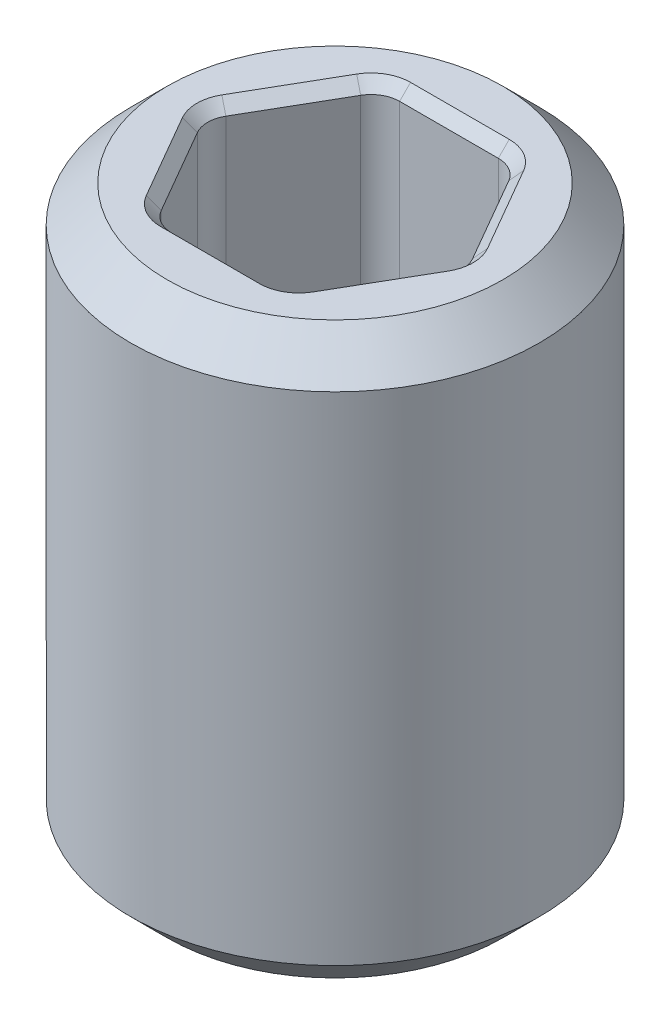
ISO-10303-21;
HEADER;
FILE_DESCRIPTION(('STEP AP214'),'2;1');
FILE_NAME('part.step','',(''),(''),'','','');
FILE_SCHEMA(('AUTOMOTIVE_DESIGN { 1 0 10303 214 1 1 1 1 }'));
ENDSEC;
DATA;
#1=APPLICATION_CONTEXT('core data for automotive mechanical design processes');
#2=APPLICATION_PROTOCOL_DEFINITION('international standard','automotive_design',2000,#1);
#3=PRODUCT_CONTEXT('',#1,'mechanical');
#4=PRODUCT('Part','Part','',(#3));
#5=PRODUCT_RELATED_PRODUCT_CATEGORY('part','',(#4));
#6=PRODUCT_DEFINITION_FORMATION('','',#4);
#7=PRODUCT_DEFINITION_CONTEXT('part definition',#1,'design');
#8=PRODUCT_DEFINITION('design','',#6,#7);
#9=PRODUCT_DEFINITION_SHAPE('','',#8);
#10=(LENGTH_UNIT() NAMED_UNIT(*) SI_UNIT(.MILLI.,.METRE.));
#11=(NAMED_UNIT(*) PLANE_ANGLE_UNIT() SI_UNIT($,.RADIAN.));
#12=(NAMED_UNIT(*) SI_UNIT($,.STERADIAN.) SOLID_ANGLE_UNIT());
#13=UNCERTAINTY_MEASURE_WITH_UNIT(LENGTH_MEASURE(1.E-05),#10,'distance_accuracy_value','');
#14=(GEOMETRIC_REPRESENTATION_CONTEXT(3) GLOBAL_UNCERTAINTY_ASSIGNED_CONTEXT((#13)) GLOBAL_UNIT_ASSIGNED_CONTEXT((#10,
#11,#12)) REPRESENTATION_CONTEXT('',''));
#15=CARTESIAN_POINT('',(0.,0.,0.));
#16=DIRECTION('',(0.,0.,1.));
#17=DIRECTION('',(1.,0.,0.));
#18=AXIS2_PLACEMENT_3D('',#15,#16,#17);
#19=CARTESIAN_POINT('',(0.,-1.984375,0.));
#20=DIRECTION('',(0.,-1.,0.));
#21=DIRECTION('',(0.,0.,-1.));
#22=AXIS2_PLACEMENT_3D('',#19,#20,#21);
#23=PLANE('',#22);
#24=CARTESIAN_POINT('',(0.343703832126949,-1.984375,0.5953125));
#25=DIRECTION('',(0.,-1.,0.));
#26=DIRECTION('',(0.,0.,-1.));
#27=AXIS2_PLACEMENT_3D('',#24,#25,#26);
#28=CIRCLE('',#27,0.2746375);
#29=CARTESIAN_POINT('',(0.343703832126949,-1.984375,0.86995));
#30=VERTEX_POINT('',#29);
#31=CARTESIAN_POINT('',(0.581546883958798,-1.984375,0.73263125));
#32=VERTEX_POINT('',#31);
#33=EDGE_CURVE('E428',#30,#32,#28,.F.);
#34=ORIENTED_EDGE('',*,*,#33,.T.);
#35=DIRECTION('',(0.499999999999999,0.,-0.866025403784439));
#36=VECTOR('',#35,1.);
#37=CARTESIAN_POINT('',(0.925250716085747,-1.984375,0.137318749999999));
#38=LINE('',#37,#36);
#39=CARTESIAN_POINT('',(0.925250716085747,-1.984375,0.137318749999999));
#40=VERTEX_POINT('',#39);
#41=EDGE_CURVE('E432',#32,#40,#38,.T.);
#42=ORIENTED_EDGE('',*,*,#41,.T.);
#43=CARTESIAN_POINT('',(0.687407664253898,-1.984375,0.));
#44=DIRECTION('',(0.,-1.,0.));
#45=DIRECTION('',(0.,0.,-1.));
#46=AXIS2_PLACEMENT_3D('',#43,#44,#45);
#47=CIRCLE('',#46,0.2746375);
#48=CARTESIAN_POINT('',(0.925250716085747,-1.984375,-0.137318750000001));
#49=VERTEX_POINT('',#48);
#50=EDGE_CURVE('E430',#40,#49,#47,.F.);
#51=ORIENTED_EDGE('',*,*,#50,.T.);
#52=DIRECTION('',(-0.5,0.,-0.866025403784439));
#53=VECTOR('',#52,1.);
#54=CARTESIAN_POINT('',(0.581546883958798,-1.984375,-0.73263125));
#55=LINE('',#54,#53);
#56=CARTESIAN_POINT('',(0.581546883958798,-1.984375,-0.73263125));
#57=VERTEX_POINT('',#56);
#58=EDGE_CURVE('E426',#49,#57,#55,.T.);
#59=ORIENTED_EDGE('',*,*,#58,.T.);
#60=CARTESIAN_POINT('',(0.343703832126949,-1.984375,-0.5953125));
#61=DIRECTION('',(0.,-1.,0.));
#62=DIRECTION('',(0.,0.,-1.));
#63=AXIS2_PLACEMENT_3D('',#60,#61,#62);
#64=CIRCLE('',#63,0.2746375);
#65=CARTESIAN_POINT('',(0.343703832126949,-1.984375,-0.86995));
#66=VERTEX_POINT('',#65);
#67=EDGE_CURVE('E418',#57,#66,#64,.F.);
#68=ORIENTED_EDGE('',*,*,#67,.T.);
#69=DIRECTION('',(-1.,0.,0.));
#70=VECTOR('',#69,1.);
#71=CARTESIAN_POINT('',(-0.343703832126949,-1.984375,-0.86995));
#72=LINE('',#71,#70);
#73=CARTESIAN_POINT('',(-0.343703832126949,-1.984375,-0.86995));
#74=VERTEX_POINT('',#73);
#75=EDGE_CURVE('E200',#66,#74,#72,.T.);
#76=ORIENTED_EDGE('',*,*,#75,.T.);
#77=CARTESIAN_POINT('',(-0.343703832126949,-1.984375,-0.5953125));
#78=DIRECTION('',(0.,-1.,0.));
#79=DIRECTION('',(0.,0.,-1.));
#80=AXIS2_PLACEMENT_3D('',#77,#78,#79);
#81=CIRCLE('',#80,0.2746375);
#82=CARTESIAN_POINT('',(-0.581546883958798,-1.984375,-0.73263125));
#83=VERTEX_POINT('',#82);
#84=EDGE_CURVE('E194',#74,#83,#81,.F.);
#85=ORIENTED_EDGE('',*,*,#84,.T.);
#86=DIRECTION('',(-0.499999999999999,0.,0.866025403784439));
#87=VECTOR('',#86,1.);
#88=CARTESIAN_POINT('',(-0.925250716085747,-1.984375,-0.137318749999999));
#89=LINE('',#88,#87);
#90=CARTESIAN_POINT('',(-0.925250716085747,-1.984375,-0.13731875));
#91=VERTEX_POINT('',#90);
#92=EDGE_CURVE('E197',#83,#91,#89,.T.);
#93=ORIENTED_EDGE('',*,*,#92,.T.);
#94=CARTESIAN_POINT('',(-0.687407664253898,-1.984375,0.));
#95=DIRECTION('',(0.,-1.,0.));
#96=DIRECTION('',(0.,0.,-1.));
#97=AXIS2_PLACEMENT_3D('',#94,#95,#96);
#98=CIRCLE('',#97,0.2746375);
#99=CARTESIAN_POINT('',(-0.925250716085747,-1.984375,0.137318750000001));
#100=VERTEX_POINT('',#99);
#101=EDGE_CURVE('E206',#91,#100,#98,.F.);
#102=ORIENTED_EDGE('',*,*,#101,.T.);
#103=DIRECTION('',(0.500000000000001,0.,0.866025403784438));
#104=VECTOR('',#103,1.);
#105=CARTESIAN_POINT('',(-0.581546883958797,-1.984375,0.732631250000001));
#106=LINE('',#105,#104);
#107=CARTESIAN_POINT('',(-0.581546883958797,-1.984375,0.73263125));
#108=VERTEX_POINT('',#107);
#109=EDGE_CURVE('E205',#100,#108,#106,.T.);
#110=ORIENTED_EDGE('',*,*,#109,.T.);
#111=CARTESIAN_POINT('',(-0.343703832126948,-1.984375,0.5953125));
#112=DIRECTION('',(0.,-1.,0.));
#113=DIRECTION('',(0.,0.,-1.));
#114=AXIS2_PLACEMENT_3D('',#111,#112,#113);
#115=CIRCLE('',#114,0.2746375);
#116=CARTESIAN_POINT('',(-0.343703832126948,-1.984375,0.86995));
#117=VERTEX_POINT('',#116);
#118=EDGE_CURVE('E416',#108,#117,#115,.F.);
#119=ORIENTED_EDGE('',*,*,#118,.T.);
#120=DIRECTION('',(1.,0.,0.));
#121=VECTOR('',#120,1.);
#122=CARTESIAN_POINT('',(0.343703832126949,-1.984375,0.86995));
#123=LINE('',#122,#121);
#124=EDGE_CURVE('E420',#117,#30,#123,.T.);
#125=ORIENTED_EDGE('',*,*,#124,.T.);
#126=EDGE_LOOP('',(#34,#42,#51,#59,#68,#76,#85,#93,#102,#110,#119,#125));
#127=FACE_BOUND('',#126,.T.);
#128=CARTESIAN_POINT('',(0.,-1.984375,0.));
#129=DIRECTION('',(0.,-1.,0.));
#130=DIRECTION('',(0.,0.,-1.));
#131=AXIS2_PLACEMENT_3D('',#128,#129,#130);
#132=CIRCLE('',#131,1.1684);
#133=CARTESIAN_POINT('',(0.,-1.984375,-1.1684));
#134=VERTEX_POINT('',#133);
#135=EDGE_CURVE('E462',#134,#134,#132,.T.);
#136=ORIENTED_EDGE('',*,*,#135,.T.);
#137=EDGE_LOOP('',(#136));
#138=FACE_BOUND('',#137,.T.);
#139=ADVANCED_FACE('F32',(#127,#138),#23,.T.);
#140=CARTESIAN_POINT('',(0.,-1.70416602917091,0.));
#141=DIRECTION('',(0.,-1.,0.));
#142=DIRECTION('',(0.,0.,-1.));
#143=AXIS2_PLACEMENT_3D('',#140,#141,#142);
#144=CYLINDRICAL_SURFACE('',#143,1.4224);
#145=CARTESIAN_POINT('',(0.,-1.730375,0.));
#146=DIRECTION('',(0.,-1.,0.));
#147=DIRECTION('',(0.,0.,-1.));
#148=AXIS2_PLACEMENT_3D('',#145,#146,#147);
#149=CIRCLE('',#148,1.4224);
#150=CARTESIAN_POINT('',(0.,-1.730375,-1.4224));
#151=VERTEX_POINT('',#150);
#152=EDGE_CURVE('E468',#151,#151,#149,.F.);
#153=ORIENTED_EDGE('',*,*,#152,.T.);
#154=EDGE_LOOP('',(#153));
#155=FACE_BOUND('',#154,.T.);
#156=CARTESIAN_POINT('',(0.,1.730375,0.));
#157=DIRECTION('',(0.,1.,0.));
#158=DIRECTION('',(0.,0.,1.));
#159=AXIS2_PLACEMENT_3D('',#156,#157,#158);
#160=CIRCLE('',#159,1.4224);
#161=CARTESIAN_POINT('',(0.,1.730375,1.4224));
#162=VERTEX_POINT('',#161);
#163=EDGE_CURVE('E465',#162,#162,#160,.F.);
#164=ORIENTED_EDGE('',*,*,#163,.T.);
#165=EDGE_LOOP('',(#164));
#166=FACE_BOUND('',#165,.T.);
#167=ADVANCED_FACE('F551',(#155,#166),#144,.T.);
#168=CARTESIAN_POINT('',(1.4224,1.984375,0.));
#169=DIRECTION('',(0.,1.,0.));
#170=DIRECTION('',(0.,0.,1.));
#171=AXIS2_PLACEMENT_3D('',#168,#169,#170);
#172=PLANE('',#171);
#173=CARTESIAN_POINT('',(0.343703832126949,1.984375,-0.5953125));
#174=DIRECTION('',(0.,1.,0.));
#175=DIRECTION('',(0.,0.,1.));
#176=AXIS2_PLACEMENT_3D('',#173,#174,#175);
#177=CIRCLE('',#176,0.274637500000002);
#178=CARTESIAN_POINT('',(0.343703832126949,1.984375,-0.869950000000002));
#179=VERTEX_POINT('',#178);
#180=CARTESIAN_POINT('',(0.581546883958799,1.984375,-0.732631250000001));
#181=VERTEX_POINT('',#180);
#182=EDGE_CURVE('E41',#179,#181,#177,.F.);
#183=ORIENTED_EDGE('',*,*,#182,.T.);
#184=DIRECTION('',(0.5,0.,0.866025403784439));
#185=VECTOR('',#184,1.);
#186=CARTESIAN_POINT('',(0.925250716085748,1.984375,-0.137318750000001));
#187=LINE('',#186,#185);
#188=CARTESIAN_POINT('',(0.925250716085748,1.984375,-0.137318750000002));
#189=VERTEX_POINT('',#188);
#190=EDGE_CURVE('E11',#181,#189,#187,.T.);
#191=ORIENTED_EDGE('',*,*,#190,.T.);
#192=CARTESIAN_POINT('',(0.687407664253898,1.984375,0.));
#193=DIRECTION('',(0.,1.,0.));
#194=DIRECTION('',(0.,0.,1.));
#195=AXIS2_PLACEMENT_3D('',#192,#193,#194);
#196=CIRCLE('',#195,0.274637500000002);
#197=CARTESIAN_POINT('',(0.925250716085748,1.984375,0.13731875));
#198=VERTEX_POINT('',#197);
#199=EDGE_CURVE('E344',#189,#198,#196,.F.);
#200=ORIENTED_EDGE('',*,*,#199,.T.);
#201=DIRECTION('',(-0.499999999999999,0.,0.866025403784439));
#202=VECTOR('',#201,1.);
#203=CARTESIAN_POINT('',(0.5815468839588,1.984375,0.732631250000001));
#204=LINE('',#203,#202);
#205=CARTESIAN_POINT('',(0.5815468839588,1.984375,0.732631250000001));
#206=VERTEX_POINT('',#205);
#207=EDGE_CURVE('E340',#198,#206,#204,.T.);
#208=ORIENTED_EDGE('',*,*,#207,.T.);
#209=CARTESIAN_POINT('',(0.343703832126949,1.984375,0.5953125));
#210=DIRECTION('',(0.,1.,0.));
#211=DIRECTION('',(0.,0.,1.));
#212=AXIS2_PLACEMENT_3D('',#209,#210,#211);
#213=CIRCLE('',#212,0.274637500000002);
#214=CARTESIAN_POINT('',(0.343703832126949,1.984375,0.869950000000002));
#215=VERTEX_POINT('',#214);
#216=EDGE_CURVE('E336',#206,#215,#213,.F.);
#217=ORIENTED_EDGE('',*,*,#216,.T.);
#218=DIRECTION('',(-1.,0.,0.));
#219=VECTOR('',#218,1.);
#220=CARTESIAN_POINT('',(-0.343703832126948,1.984375,0.869950000000002));
#221=LINE('',#220,#219);
#222=CARTESIAN_POINT('',(-0.343703832126948,1.984375,0.869950000000002));
#223=VERTEX_POINT('',#222);
#224=EDGE_CURVE('E332',#215,#223,#221,.T.);
#225=ORIENTED_EDGE('',*,*,#224,.T.);
#226=CARTESIAN_POINT('',(-0.343703832126948,1.984375,0.5953125));
#227=DIRECTION('',(0.,1.,0.));
#228=DIRECTION('',(0.,0.,1.));
#229=AXIS2_PLACEMENT_3D('',#226,#227,#228);
#230=CIRCLE('',#229,0.274637500000002);
#231=CARTESIAN_POINT('',(-0.581546883958799,1.984375,0.732631250000001));
#232=VERTEX_POINT('',#231);
#233=EDGE_CURVE('E328',#223,#232,#230,.F.);
#234=ORIENTED_EDGE('',*,*,#233,.T.);
#235=DIRECTION('',(-0.500000000000001,0.,-0.866025403784438));
#236=VECTOR('',#235,1.);
#237=CARTESIAN_POINT('',(-0.925250716085748,1.984375,0.137318750000002));
#238=LINE('',#237,#236);
#239=CARTESIAN_POINT('',(-0.925250716085748,1.984375,0.137318750000002));
#240=VERTEX_POINT('',#239);
#241=EDGE_CURVE('E326',#232,#240,#238,.T.);
#242=ORIENTED_EDGE('',*,*,#241,.T.);
#243=CARTESIAN_POINT('',(-0.687407664253898,1.984375,0.));
#244=DIRECTION('',(0.,1.,0.));
#245=DIRECTION('',(0.,0.,1.));
#246=AXIS2_PLACEMENT_3D('',#243,#244,#245);
#247=CIRCLE('',#246,0.274637500000002);
#248=CARTESIAN_POINT('',(-0.925250716085748,1.984375,-0.13731875));
#249=VERTEX_POINT('',#248);
#250=EDGE_CURVE('E330',#240,#249,#247,.F.);
#251=ORIENTED_EDGE('',*,*,#250,.T.);
#252=DIRECTION('',(0.499999999999999,0.,-0.866025403784439));
#253=VECTOR('',#252,1.);
#254=CARTESIAN_POINT('',(-0.5815468839588,1.984375,-0.732631250000001));
#255=LINE('',#254,#253);
#256=CARTESIAN_POINT('',(-0.5815468839588,1.984375,-0.732631250000001));
#257=VERTEX_POINT('',#256);
#258=EDGE_CURVE('E334',#249,#257,#255,.T.);
#259=ORIENTED_EDGE('',*,*,#258,.T.);
#260=CARTESIAN_POINT('',(-0.343703832126949,1.984375,-0.5953125));
#261=DIRECTION('',(0.,1.,0.));
#262=DIRECTION('',(0.,0.,1.));
#263=AXIS2_PLACEMENT_3D('',#260,#261,#262);
#264=CIRCLE('',#263,0.274637500000002);
#265=CARTESIAN_POINT('',(-0.343703832126949,1.984375,-0.869950000000002));
#266=VERTEX_POINT('',#265);
#267=EDGE_CURVE('E338',#257,#266,#264,.F.);
#268=ORIENTED_EDGE('',*,*,#267,.T.);
#269=DIRECTION('',(1.,0.,0.));
#270=VECTOR('',#269,1.);
#271=CARTESIAN_POINT('',(0.343703832126949,1.984375,-0.869950000000002));
#272=LINE('',#271,#270);
#273=EDGE_CURVE('E342',#266,#179,#272,.T.);
#274=ORIENTED_EDGE('',*,*,#273,.T.);
#275=EDGE_LOOP('',(#183,#191,#200,#208,#217,#225,#234,#242,#251,#259,#268,#274));
#276=FACE_BOUND('',#275,.T.);
#277=CARTESIAN_POINT('',(0.,1.984375,0.));
#278=DIRECTION('',(0.,1.,0.));
#279=DIRECTION('',(0.,0.,1.));
#280=AXIS2_PLACEMENT_3D('',#277,#278,#279);
#281=CIRCLE('',#280,1.1684);
#282=CARTESIAN_POINT('',(0.,1.984375,1.1684));
#283=VERTEX_POINT('',#282);
#284=EDGE_CURVE('E217',#283,#283,#281,.T.);
#285=ORIENTED_EDGE('',*,*,#284,.T.);
#286=EDGE_LOOP('',(#285));
#287=FACE_BOUND('',#286,.T.);
#288=ADVANCED_FACE('F346',(#276,#287),#172,.T.);
#289=CARTESIAN_POINT('',(0.91654355233853,-1.984375,0.));
#290=DIRECTION('',(0.866025403784439,0.,-0.5));
#291=DIRECTION('',(-0.5,0.,-0.866025403784439));
#292=AXIS2_PLACEMENT_3D('',#289,#290,#291);
#293=PLANE('',#292);
#294=DIRECTION('',(0.,1.,0.));
#295=VECTOR('',#294,1.);
#296=CARTESIAN_POINT('',(0.515555748190423,-1.984375,-0.69453125));
#297=LINE('',#296,#295);
#298=CARTESIAN_POINT('',(0.515555748190423,1.908175,-0.69453125));
#299=VERTEX_POINT('',#298);
#300=CARTESIAN_POINT('',(0.515555748190423,-1.908175,-0.69453125));
#301=VERTEX_POINT('',#300);
#302=EDGE_CURVE('E223',#299,#301,#297,.F.);
#303=ORIENTED_EDGE('',*,*,#302,.T.);
#304=DIRECTION('',(0.5,0.,0.866025403784439));
#305=VECTOR('',#304,1.);
#306=CARTESIAN_POINT('',(0.859259580317372,-1.908175,-0.0992187500000006));
#307=LINE('',#306,#305);
#308=CARTESIAN_POINT('',(0.859259580317372,-1.908175,-0.0992187500000006));
#309=VERTEX_POINT('',#308);
#310=EDGE_CURVE('E378',#301,#309,#307,.T.);
#311=ORIENTED_EDGE('',*,*,#310,.T.);
#312=DIRECTION('',(0.,1.,0.));
#313=VECTOR('',#312,1.);
#314=CARTESIAN_POINT('',(0.859259580317372,1.984375,-0.0992187500000006));
#315=LINE('',#314,#313);
#316=CARTESIAN_POINT('',(0.859259580317372,1.908175,-0.0992187500000006));
#317=VERTEX_POINT('',#316);
#318=EDGE_CURVE('E446',#309,#317,#315,.T.);
#319=ORIENTED_EDGE('',*,*,#318,.T.);
#320=DIRECTION('',(-0.5,0.,-0.866025403784439));
#321=VECTOR('',#320,1.);
#322=CARTESIAN_POINT('',(0.515555748190423,1.908175,-0.69453125));
#323=LINE('',#322,#321);
#324=EDGE_CURVE('E375',#317,#299,#323,.T.);
#325=ORIENTED_EDGE('',*,*,#324,.T.);
#326=EDGE_LOOP('',(#303,#311,#319,#325));
#327=FACE_BOUND('',#326,.T.);
#328=ADVANCED_FACE('F530',(#327),#293,.F.);
#329=CARTESIAN_POINT('',(0.458271776169266,-1.984375,0.79375));
#330=DIRECTION('',(0.866025403784439,0.,0.499999999999999));
#331=DIRECTION('',(0.499999999999999,0.,-0.866025403784439));
#332=AXIS2_PLACEMENT_3D('',#329,#330,#331);
#333=PLANE('',#332);
#334=DIRECTION('',(0.,1.,0.));
#335=VECTOR('',#334,1.);
#336=CARTESIAN_POINT('',(0.859259580317372,-1.984375,0.0992187499999992));
#337=LINE('',#336,#335);
#338=CARTESIAN_POINT('',(0.859259580317372,1.908175,0.0992187499999992));
#339=VERTEX_POINT('',#338);
#340=CARTESIAN_POINT('',(0.859259580317372,-1.908175,0.0992187499999992));
#341=VERTEX_POINT('',#340);
#342=EDGE_CURVE('E438',#339,#341,#337,.F.);
#343=ORIENTED_EDGE('',*,*,#342,.T.);
#344=DIRECTION('',(-0.499999999999999,0.,0.866025403784439));
#345=VECTOR('',#344,1.);
#346=CARTESIAN_POINT('',(0.515555748190424,-1.908175,0.69453125));
#347=LINE('',#346,#345);
#348=CARTESIAN_POINT('',(0.515555748190424,-1.908175,0.69453125));
#349=VERTEX_POINT('',#348);
#350=EDGE_CURVE('E363',#341,#349,#347,.T.);
#351=ORIENTED_EDGE('',*,*,#350,.T.);
#352=DIRECTION('',(0.,1.,0.));
#353=VECTOR('',#352,1.);
#354=CARTESIAN_POINT('',(0.515555748190424,1.984375,0.69453125));
#355=LINE('',#354,#353);
#356=CARTESIAN_POINT('',(0.515555748190424,1.908175,0.69453125));
#357=VERTEX_POINT('',#356);
#358=EDGE_CURVE('E440',#349,#357,#355,.T.);
#359=ORIENTED_EDGE('',*,*,#358,.T.);
#360=DIRECTION('',(0.499999999999999,0.,-0.866025403784439));
#361=VECTOR('',#360,1.);
#362=CARTESIAN_POINT('',(0.859259580317373,1.908175,0.099218749999999));
#363=LINE('',#362,#361);
#364=EDGE_CURVE('E368',#357,#339,#363,.T.);
#365=ORIENTED_EDGE('',*,*,#364,.T.);
#366=EDGE_LOOP('',(#343,#351,#359,#365));
#367=FACE_BOUND('',#366,.T.);
#368=ADVANCED_FACE('F437',(#367),#333,.F.);
#369=CARTESIAN_POINT('',(-0.458271776169265,-1.984375,0.79375));
#370=DIRECTION('',(0.,0.,1.));
#371=DIRECTION('',(1.,0.,0.));
#372=AXIS2_PLACEMENT_3D('',#369,#370,#371);
#373=PLANE('',#372);
#374=DIRECTION('',(0.,1.,0.));
#375=VECTOR('',#374,1.);
#376=CARTESIAN_POINT('',(0.343703832126949,-1.984375,0.79375));
#377=LINE('',#376,#375);
#378=CARTESIAN_POINT('',(0.343703832126949,1.908175,0.79375));
#379=VERTEX_POINT('',#378);
#380=CARTESIAN_POINT('',(0.343703832126949,-1.908175,0.79375));
#381=VERTEX_POINT('',#380);
#382=EDGE_CURVE('E444',#379,#381,#377,.F.);
#383=ORIENTED_EDGE('',*,*,#382,.T.);
#384=DIRECTION('',(-1.,0.,0.));
#385=VECTOR('',#384,1.);
#386=CARTESIAN_POINT('',(-0.343703832126948,-1.908175,0.79375));
#387=LINE('',#386,#385);
#388=CARTESIAN_POINT('',(-0.343703832126948,-1.908175,0.79375));
#389=VERTEX_POINT('',#388);
#390=EDGE_CURVE('E382',#381,#389,#387,.T.);
#391=ORIENTED_EDGE('',*,*,#390,.T.);
#392=DIRECTION('',(0.,1.,0.));
#393=VECTOR('',#392,1.);
#394=CARTESIAN_POINT('',(-0.343703832126948,1.984375,0.79375));
#395=LINE('',#394,#393);
#396=CARTESIAN_POINT('',(-0.343703832126948,1.908175,0.79375));
#397=VERTEX_POINT('',#396);
#398=EDGE_CURVE('E397',#389,#397,#395,.T.);
#399=ORIENTED_EDGE('',*,*,#398,.T.);
#400=DIRECTION('',(1.,0.,0.));
#401=VECTOR('',#400,1.);
#402=CARTESIAN_POINT('',(0.343703832126949,1.908175,0.79375));
#403=LINE('',#402,#401);
#404=EDGE_CURVE('E380',#397,#379,#403,.T.);
#405=ORIENTED_EDGE('',*,*,#404,.T.);
#406=EDGE_LOOP('',(#383,#391,#399,#405));
#407=FACE_BOUND('',#406,.T.);
#408=ADVANCED_FACE('F502',(#407),#373,.F.);
#409=CARTESIAN_POINT('',(-0.916543552338531,-1.984375,0.));
#410=DIRECTION('',(-0.866025403784438,0.,0.500000000000001));
#411=DIRECTION('',(0.500000000000001,0.,0.866025403784438));
#412=AXIS2_PLACEMENT_3D('',#409,#410,#411);
#413=PLANE('',#412);
#414=DIRECTION('',(0.,1.,0.));
#415=VECTOR('',#414,1.);
#416=CARTESIAN_POINT('',(-0.515555748190423,-1.984375,0.69453125));
#417=LINE('',#416,#415);
#418=CARTESIAN_POINT('',(-0.515555748190423,1.908175,0.69453125));
#419=VERTEX_POINT('',#418);
#420=CARTESIAN_POINT('',(-0.515555748190423,-1.908175,0.69453125));
#421=VERTEX_POINT('',#420);
#422=EDGE_CURVE('E395',#419,#421,#417,.F.);
#423=ORIENTED_EDGE('',*,*,#422,.T.);
#424=DIRECTION('',(-0.500000000000001,0.,-0.866025403784438));
#425=VECTOR('',#424,1.);
#426=CARTESIAN_POINT('',(-0.859259580317372,-1.908175,0.0992187500000005));
#427=LINE('',#426,#425);
#428=CARTESIAN_POINT('',(-0.859259580317372,-1.908175,0.0992187500000005));
#429=VERTEX_POINT('',#428);
#430=EDGE_CURVE('E308',#421,#429,#427,.T.);
#431=ORIENTED_EDGE('',*,*,#430,.T.);
#432=DIRECTION('',(0.,1.,0.));
#433=VECTOR('',#432,1.);
#434=CARTESIAN_POINT('',(-0.859259580317372,1.984375,0.0992187500000005));
#435=LINE('',#434,#433);
#436=CARTESIAN_POINT('',(-0.859259580317372,1.908175,0.0992187500000005));
#437=VERTEX_POINT('',#436);
#438=EDGE_CURVE('E407',#429,#437,#435,.T.);
#439=ORIENTED_EDGE('',*,*,#438,.T.);
#440=DIRECTION('',(0.500000000000001,0.,0.866025403784438));
#441=VECTOR('',#440,1.);
#442=CARTESIAN_POINT('',(-0.515555748190423,1.908175,0.69453125));
#443=LINE('',#442,#441);
#444=EDGE_CURVE('E305',#437,#419,#443,.T.);
#445=ORIENTED_EDGE('',*,*,#444,.T.);
#446=EDGE_LOOP('',(#423,#431,#439,#445));
#447=FACE_BOUND('',#446,.T.);
#448=ADVANCED_FACE('F402',(#447),#413,.F.);
#449=CARTESIAN_POINT('',(-0.458271776169266,-1.984375,-0.79375));
#450=DIRECTION('',(-0.866025403784439,0.,-0.499999999999999));
#451=DIRECTION('',(-0.499999999999999,0.,0.866025403784439));
#452=AXIS2_PLACEMENT_3D('',#449,#450,#451);
#453=PLANE('',#452);
#454=DIRECTION('',(0.,1.,0.));
#455=VECTOR('',#454,1.);
#456=CARTESIAN_POINT('',(-0.859259580317372,-1.984375,-0.0992187499999994));
#457=LINE('',#456,#455);
#458=CARTESIAN_POINT('',(-0.859259580317372,1.908175,-0.0992187499999994));
#459=VERTEX_POINT('',#458);
#460=CARTESIAN_POINT('',(-0.859259580317372,-1.908175,-0.0992187499999994));
#461=VERTEX_POINT('',#460);
#462=EDGE_CURVE('E455',#459,#461,#457,.F.);
#463=ORIENTED_EDGE('',*,*,#462,.T.);
#464=DIRECTION('',(0.499999999999999,0.,-0.866025403784439));
#465=VECTOR('',#464,1.);
#466=CARTESIAN_POINT('',(-0.515555748190424,-1.908175,-0.69453125));
#467=LINE('',#466,#465);
#468=CARTESIAN_POINT('',(-0.515555748190424,-1.908175,-0.69453125));
#469=VERTEX_POINT('',#468);
#470=EDGE_CURVE('E324',#461,#469,#467,.T.);
#471=ORIENTED_EDGE('',*,*,#470,.T.);
#472=DIRECTION('',(0.,1.,0.));
#473=VECTOR('',#472,1.);
#474=CARTESIAN_POINT('',(-0.515555748190424,1.984375,-0.69453125));
#475=LINE('',#474,#473);
#476=CARTESIAN_POINT('',(-0.515555748190424,1.908175,-0.69453125));
#477=VERTEX_POINT('',#476);
#478=EDGE_CURVE('E406',#469,#477,#475,.T.);
#479=ORIENTED_EDGE('',*,*,#478,.T.);
#480=DIRECTION('',(-0.499999999999999,0.,0.866025403784439));
#481=VECTOR('',#480,1.);
#482=CARTESIAN_POINT('',(-0.859259580317372,1.908175,-0.0992187499999994));
#483=LINE('',#482,#481);
#484=EDGE_CURVE('E322',#477,#459,#483,.T.);
#485=ORIENTED_EDGE('',*,*,#484,.T.);
#486=EDGE_LOOP('',(#463,#471,#479,#485));
#487=FACE_BOUND('',#486,.T.);
#488=ADVANCED_FACE('F480',(#487),#453,.F.);
#489=CARTESIAN_POINT('',(0.458271776169265,-1.984375,-0.79375));
#490=DIRECTION('',(0.,0.,-1.));
#491=DIRECTION('',(-1.,0.,0.));
#492=AXIS2_PLACEMENT_3D('',#489,#490,#491);
#493=PLANE('',#492);
#494=DIRECTION('',(0.,1.,0.));
#495=VECTOR('',#494,1.);
#496=CARTESIAN_POINT('',(-0.343703832126949,-1.984375,-0.79375));
#497=LINE('',#496,#495);
#498=CARTESIAN_POINT('',(-0.343703832126949,1.908175,-0.79375));
#499=VERTEX_POINT('',#498);
#500=CARTESIAN_POINT('',(-0.343703832126949,-1.908175,-0.79375));
#501=VERTEX_POINT('',#500);
#502=EDGE_CURVE('E460',#499,#501,#497,.F.);
#503=ORIENTED_EDGE('',*,*,#502,.T.);
#504=DIRECTION('',(1.,0.,0.));
#505=VECTOR('',#504,1.);
#506=CARTESIAN_POINT('',(0.343703832126949,-1.908175,-0.79375));
#507=LINE('',#506,#505);
#508=CARTESIAN_POINT('',(0.343703832126949,-1.908175,-0.79375));
#509=VERTEX_POINT('',#508);
#510=EDGE_CURVE('E299',#501,#509,#507,.T.);
#511=ORIENTED_EDGE('',*,*,#510,.T.);
#512=DIRECTION('',(0.,1.,0.));
#513=VECTOR('',#512,1.);
#514=CARTESIAN_POINT('',(0.343703832126949,1.984375,-0.79375));
#515=LINE('',#514,#513);
#516=CARTESIAN_POINT('',(0.343703832126949,1.908175,-0.79375));
#517=VERTEX_POINT('',#516);
#518=EDGE_CURVE('E458',#509,#517,#515,.T.);
#519=ORIENTED_EDGE('',*,*,#518,.T.);
#520=DIRECTION('',(-1.,0.,0.));
#521=VECTOR('',#520,1.);
#522=CARTESIAN_POINT('',(-0.343703832126949,1.908175,-0.79375));
#523=LINE('',#522,#521);
#524=EDGE_CURVE('E306',#517,#499,#523,.T.);
#525=ORIENTED_EDGE('',*,*,#524,.T.);
#526=EDGE_LOOP('',(#503,#511,#519,#525));
#527=FACE_BOUND('',#526,.T.);
#528=ADVANCED_FACE('F538',(#527),#493,.F.);
#529=CARTESIAN_POINT('',(0.687407664253898,-1.984375,0.));
#530=DIRECTION('',(0.,-1.,0.));
#531=DIRECTION('',(0.,0.,-1.));
#532=AXIS2_PLACEMENT_3D('',#529,#530,#531);
#533=CYLINDRICAL_SURFACE('',#532,0.1984375);
#534=ORIENTED_EDGE('',*,*,#318,.F.);
#535=CARTESIAN_POINT('',(0.687407664253898,-1.908175,0.));
#536=DIRECTION('',(0.,-1.,0.));
#537=DIRECTION('',(0.,0.,-1.));
#538=AXIS2_PLACEMENT_3D('',#535,#536,#537);
#539=CIRCLE('',#538,0.1984375);
#540=EDGE_CURVE('E362',#309,#341,#539,.T.);
#541=ORIENTED_EDGE('',*,*,#540,.T.);
#542=ORIENTED_EDGE('',*,*,#342,.F.);
#543=CARTESIAN_POINT('',(0.687407664253898,1.908175,0.));
#544=DIRECTION('',(0.,1.,0.));
#545=DIRECTION('',(0.,0.,1.));
#546=AXIS2_PLACEMENT_3D('',#543,#544,#545);
#547=CIRCLE('',#546,0.1984375);
#548=EDGE_CURVE('E357',#339,#317,#547,.T.);
#549=ORIENTED_EDGE('',*,*,#548,.T.);
#550=EDGE_LOOP('',(#534,#541,#542,#549));
#551=FACE_BOUND('',#550,.T.);
#552=ADVANCED_FACE('F441',(#551),#533,.F.);
#553=CARTESIAN_POINT('',(0.343703832126949,-1.984375,0.5953125));
#554=DIRECTION('',(0.,-1.,0.));
#555=DIRECTION('',(0.,0.,-1.));
#556=AXIS2_PLACEMENT_3D('',#553,#554,#555);
#557=CYLINDRICAL_SURFACE('',#556,0.1984375);
#558=ORIENTED_EDGE('',*,*,#358,.F.);
#559=CARTESIAN_POINT('',(0.343703832126949,-1.908175,0.5953125));
#560=DIRECTION('',(0.,-1.,0.));
#561=DIRECTION('',(0.,0.,-1.));
#562=AXIS2_PLACEMENT_3D('',#559,#560,#561);
#563=CIRCLE('',#562,0.1984375);
#564=EDGE_CURVE('E373',#349,#381,#563,.T.);
#565=ORIENTED_EDGE('',*,*,#564,.T.);
#566=ORIENTED_EDGE('',*,*,#382,.F.);
#567=CARTESIAN_POINT('',(0.343703832126949,1.908175,0.5953125));
#568=DIRECTION('',(0.,1.,0.));
#569=DIRECTION('',(0.,0.,1.));
#570=AXIS2_PLACEMENT_3D('',#567,#568,#569);
#571=CIRCLE('',#570,0.1984375);
#572=EDGE_CURVE('E365',#379,#357,#571,.T.);
#573=ORIENTED_EDGE('',*,*,#572,.T.);
#574=EDGE_LOOP('',(#558,#565,#566,#573));
#575=FACE_BOUND('',#574,.T.);
#576=ADVANCED_FACE('F562',(#575),#557,.F.);
#577=CARTESIAN_POINT('',(-0.343703832126948,-1.984375,0.5953125));
#578=DIRECTION('',(0.,-1.,0.));
#579=DIRECTION('',(0.,0.,-1.));
#580=AXIS2_PLACEMENT_3D('',#577,#578,#579);
#581=CYLINDRICAL_SURFACE('',#580,0.1984375);
#582=ORIENTED_EDGE('',*,*,#398,.F.);
#583=CARTESIAN_POINT('',(-0.343703832126948,-1.908175,0.5953125));
#584=DIRECTION('',(0.,-1.,0.));
#585=DIRECTION('',(0.,0.,-1.));
#586=AXIS2_PLACEMENT_3D('',#583,#584,#585);
#587=CIRCLE('',#586,0.1984375);
#588=EDGE_CURVE('E310',#389,#421,#587,.T.);
#589=ORIENTED_EDGE('',*,*,#588,.T.);
#590=ORIENTED_EDGE('',*,*,#422,.F.);
#591=CARTESIAN_POINT('',(-0.343703832126948,1.908175,0.5953125));
#592=DIRECTION('',(0.,1.,0.));
#593=DIRECTION('',(0.,0.,1.));
#594=AXIS2_PLACEMENT_3D('',#591,#592,#593);
#595=CIRCLE('',#594,0.1984375);
#596=EDGE_CURVE('E388',#419,#397,#595,.T.);
#597=ORIENTED_EDGE('',*,*,#596,.T.);
#598=EDGE_LOOP('',(#582,#589,#590,#597));
#599=FACE_BOUND('',#598,.T.);
#600=ADVANCED_FACE('F394',(#599),#581,.F.);
#601=CARTESIAN_POINT('',(-0.687407664253898,-1.984375,0.));
#602=DIRECTION('',(0.,-1.,0.));
#603=DIRECTION('',(0.,0.,-1.));
#604=AXIS2_PLACEMENT_3D('',#601,#602,#603);
#605=CYLINDRICAL_SURFACE('',#604,0.1984375);
#606=ORIENTED_EDGE('',*,*,#438,.F.);
#607=CARTESIAN_POINT('',(-0.687407664253898,-1.908175,0.));
#608=DIRECTION('',(0.,-1.,0.));
#609=DIRECTION('',(0.,0.,-1.));
#610=AXIS2_PLACEMENT_3D('',#607,#608,#609);
#611=CIRCLE('',#610,0.1984375);
#612=EDGE_CURVE('E320',#429,#461,#611,.T.);
#613=ORIENTED_EDGE('',*,*,#612,.T.);
#614=ORIENTED_EDGE('',*,*,#462,.F.);
#615=CARTESIAN_POINT('',(-0.687407664253898,1.908175,0.));
#616=DIRECTION('',(0.,1.,0.));
#617=DIRECTION('',(0.,0.,1.));
#618=AXIS2_PLACEMENT_3D('',#615,#616,#617);
#619=CIRCLE('',#618,0.1984375);
#620=EDGE_CURVE('E318',#459,#437,#619,.T.);
#621=ORIENTED_EDGE('',*,*,#620,.T.);
#622=EDGE_LOOP('',(#606,#613,#614,#621));
#623=FACE_BOUND('',#622,.T.);
#624=ADVANCED_FACE('F478',(#623),#605,.F.);
#625=CARTESIAN_POINT('',(-0.343703832126949,-1.984375,-0.5953125));
#626=DIRECTION('',(0.,-1.,0.));
#627=DIRECTION('',(0.,0.,-1.));
#628=AXIS2_PLACEMENT_3D('',#625,#626,#627);
#629=CYLINDRICAL_SURFACE('',#628,0.1984375);
#630=ORIENTED_EDGE('',*,*,#478,.F.);
#631=CARTESIAN_POINT('',(-0.343703832126949,-1.908175,-0.5953125));
#632=DIRECTION('',(0.,-1.,0.));
#633=DIRECTION('',(0.,0.,-1.));
#634=AXIS2_PLACEMENT_3D('',#631,#632,#633);
#635=CIRCLE('',#634,0.1984375);
#636=EDGE_CURVE('E220',#469,#501,#635,.T.);
#637=ORIENTED_EDGE('',*,*,#636,.T.);
#638=ORIENTED_EDGE('',*,*,#502,.F.);
#639=CARTESIAN_POINT('',(-0.343703832126949,1.908175,-0.5953125));
#640=DIRECTION('',(0.,1.,0.));
#641=DIRECTION('',(0.,0.,1.));
#642=AXIS2_PLACEMENT_3D('',#639,#640,#641);
#643=CIRCLE('',#642,0.1984375);
#644=EDGE_CURVE('E315',#499,#477,#643,.T.);
#645=ORIENTED_EDGE('',*,*,#644,.T.);
#646=EDGE_LOOP('',(#630,#637,#638,#645));
#647=FACE_BOUND('',#646,.T.);
#648=ADVANCED_FACE('F570',(#647),#629,.F.);
#649=CARTESIAN_POINT('',(0.343703832126949,-1.984375,-0.5953125));
#650=DIRECTION('',(0.,-1.,0.));
#651=DIRECTION('',(0.,0.,-1.));
#652=AXIS2_PLACEMENT_3D('',#649,#650,#651);
#653=CYLINDRICAL_SURFACE('',#652,0.1984375);
#654=ORIENTED_EDGE('',*,*,#518,.F.);
#655=CARTESIAN_POINT('',(0.343703832126949,-1.908175,-0.5953125));
#656=DIRECTION('',(0.,-1.,0.));
#657=DIRECTION('',(0.,0.,-1.));
#658=AXIS2_PLACEMENT_3D('',#655,#656,#657);
#659=CIRCLE('',#658,0.1984375);
#660=EDGE_CURVE('E386',#509,#301,#659,.T.);
#661=ORIENTED_EDGE('',*,*,#660,.T.);
#662=ORIENTED_EDGE('',*,*,#302,.F.);
#663=CARTESIAN_POINT('',(0.343703832126949,1.908175,-0.5953125));
#664=DIRECTION('',(0.,1.,0.));
#665=DIRECTION('',(0.,0.,1.));
#666=AXIS2_PLACEMENT_3D('',#663,#664,#665);
#667=CIRCLE('',#666,0.1984375);
#668=EDGE_CURVE('E384',#299,#517,#667,.T.);
#669=ORIENTED_EDGE('',*,*,#668,.T.);
#670=EDGE_LOOP('',(#654,#661,#662,#669));
#671=FACE_BOUND('',#670,.T.);
#672=ADVANCED_FACE('F528',(#671),#653,.F.);
#673=CARTESIAN_POINT('',(0.,-1.984375,0.));
#674=DIRECTION('',(0.,1.,0.));
#675=DIRECTION('',(0.,0.,1.));
#676=AXIS2_PLACEMENT_3D('',#673,#674,#675);
#677=CONICAL_SURFACE('',#676,1.1684,0.785398163397445);
#678=ORIENTED_EDGE('',*,*,#152,.F.);
#679=EDGE_LOOP('',(#678));
#680=FACE_BOUND('',#679,.T.);
#681=ORIENTED_EDGE('',*,*,#135,.F.);
#682=EDGE_LOOP('',(#681));
#683=FACE_BOUND('',#682,.T.);
#684=ADVANCED_FACE('F576',(#680,#683),#677,.T.);
#685=CARTESIAN_POINT('',(0.,1.730375,0.));
#686=DIRECTION('',(0.,-1.,0.));
#687=DIRECTION('',(0.,0.,-1.));
#688=AXIS2_PLACEMENT_3D('',#685,#686,#687);
#689=CONICAL_SURFACE('',#688,1.4224,0.78539816339745);
#690=ORIENTED_EDGE('',*,*,#284,.F.);
#691=EDGE_LOOP('',(#690));
#692=FACE_BOUND('',#691,.T.);
#693=ORIENTED_EDGE('',*,*,#163,.F.);
#694=EDGE_LOOP('',(#693));
#695=FACE_BOUND('',#694,.T.);
#696=ADVANCED_FACE('F579',(#692,#695),#689,.T.);
#697=CARTESIAN_POINT('',(-0.753398800022273,-1.984375,-0.434975));
#698=DIRECTION('',(0.612372435695798,-0.707106781186544,0.353553390593275));
#699=DIRECTION('',(0.499999999999999,0.,-0.866025403784439));
#700=AXIS2_PLACEMENT_3D('',#697,#698,#699);
#701=PLANE('',#700);
#702=DIRECTION('',(-0.612372435695791,-0.707106781186551,-0.353553390593272));
#703=VECTOR('',#702,1.);
#704=CARTESIAN_POINT('',(-0.515555748190424,-1.908175,-0.69453125));
#705=LINE('',#704,#703);
#706=EDGE_CURVE('E212',#469,#83,#705,.T.);
#707=ORIENTED_EDGE('',*,*,#706,.F.);
#708=ORIENTED_EDGE('',*,*,#470,.F.);
#709=DIRECTION('',(0.612372435695792,0.707106781186551,0.353553390593272));
#710=VECTOR('',#709,1.);
#711=CARTESIAN_POINT('',(-0.925250716085747,-1.984375,-0.13731875));
#712=LINE('',#711,#710);
#713=EDGE_CURVE('E215',#91,#461,#712,.T.);
#714=ORIENTED_EDGE('',*,*,#713,.F.);
#715=ORIENTED_EDGE('',*,*,#92,.F.);
#716=EDGE_LOOP('',(#707,#708,#714,#715));
#717=FACE_BOUND('',#716,.T.);
#718=ADVANCED_FACE('F210',(#717),#701,.T.);
#719=CARTESIAN_POINT('',(-0.687407664253898,-1.984375,0.));
#720=DIRECTION('',(0.,-1.,0.));
#721=DIRECTION('',(0.,0.,-1.));
#722=AXIS2_PLACEMENT_3D('',#719,#720,#721);
#723=CONICAL_SURFACE('',#722,0.2746375,0.785398163397443);
#724=ORIENTED_EDGE('',*,*,#713,.T.);
#725=ORIENTED_EDGE('',*,*,#612,.F.);
#726=DIRECTION('',(0.612372435695791,0.707106781186551,-0.353553390593272));
#727=VECTOR('',#726,1.);
#728=CARTESIAN_POINT('',(-0.925250716085747,-1.984375,0.137318750000001));
#729=LINE('',#728,#727);
#730=EDGE_CURVE('E221',#100,#429,#729,.T.);
#731=ORIENTED_EDGE('',*,*,#730,.F.);
#732=ORIENTED_EDGE('',*,*,#101,.F.);
#733=EDGE_LOOP('',(#724,#725,#731,#732));
#734=FACE_BOUND('',#733,.T.);
#735=ADVANCED_FACE('F475',(#734),#723,.F.);
#736=CARTESIAN_POINT('',(-0.343703832126949,-1.984375,-0.5953125));
#737=DIRECTION('',(0.,-1.,0.));
#738=DIRECTION('',(0.,0.,-1.));
#739=AXIS2_PLACEMENT_3D('',#736,#737,#738);
#740=CONICAL_SURFACE('',#739,0.2746375,0.785398163397443);
#741=ORIENTED_EDGE('',*,*,#706,.T.);
#742=ORIENTED_EDGE('',*,*,#84,.F.);
#743=DIRECTION('',(0.,-0.707106781186551,-0.707106781186544));
#744=VECTOR('',#743,1.);
#745=CARTESIAN_POINT('',(-0.343703832126949,-1.908175,-0.79375));
#746=LINE('',#745,#744);
#747=EDGE_CURVE('E226',#501,#74,#746,.T.);
#748=ORIENTED_EDGE('',*,*,#747,.F.);
#749=ORIENTED_EDGE('',*,*,#636,.F.);
#750=EDGE_LOOP('',(#741,#742,#748,#749));
#751=FACE_BOUND('',#750,.T.);
#752=ADVANCED_FACE('F219',(#751),#740,.F.);
#753=CARTESIAN_POINT('',(-0.753398800022272,-1.984375,0.434975000000001));
#754=DIRECTION('',(0.612372435695798,-0.707106781186543,-0.353553390593276));
#755=DIRECTION('',(-0.500000000000001,0.,-0.866025403784438));
#756=AXIS2_PLACEMENT_3D('',#753,#754,#755);
#757=PLANE('',#756);
#758=ORIENTED_EDGE('',*,*,#730,.T.);
#759=ORIENTED_EDGE('',*,*,#430,.F.);
#760=DIRECTION('',(0.612372435695791,0.707106781186552,-0.353553390593271));
#761=VECTOR('',#760,1.);
#762=CARTESIAN_POINT('',(-0.581546883958797,-1.984375,0.73263125));
#763=LINE('',#762,#761);
#764=EDGE_CURVE('E293',#108,#421,#763,.T.);
#765=ORIENTED_EDGE('',*,*,#764,.F.);
#766=ORIENTED_EDGE('',*,*,#109,.F.);
#767=EDGE_LOOP('',(#758,#759,#765,#766));
#768=FACE_BOUND('',#767,.T.);
#769=ADVANCED_FACE('F411',(#768),#757,.T.);
#770=CARTESIAN_POINT('',(0.,-1.984375,-0.86995));
#771=DIRECTION('',(0.,-0.707106781186544,0.707106781186551));
#772=DIRECTION('',(1.,0.,0.));
#773=AXIS2_PLACEMENT_3D('',#770,#771,#772);
#774=PLANE('',#773);
#775=ORIENTED_EDGE('',*,*,#747,.T.);
#776=ORIENTED_EDGE('',*,*,#75,.F.);
#777=DIRECTION('',(0.,-0.707106781186551,-0.707106781186544));
#778=VECTOR('',#777,1.);
#779=CARTESIAN_POINT('',(0.343703832126949,-1.908175,-0.79375));
#780=LINE('',#779,#778);
#781=EDGE_CURVE('E290',#509,#66,#780,.T.);
#782=ORIENTED_EDGE('',*,*,#781,.F.);
#783=ORIENTED_EDGE('',*,*,#510,.F.);
#784=EDGE_LOOP('',(#775,#776,#782,#783));
#785=FACE_BOUND('',#784,.T.);
#786=ADVANCED_FACE('F297',(#785),#774,.T.);
#787=CARTESIAN_POINT('',(-0.343703832126948,-1.984375,0.5953125));
#788=DIRECTION('',(0.,-1.,0.));
#789=DIRECTION('',(0.,0.,-1.));
#790=AXIS2_PLACEMENT_3D('',#787,#788,#789);
#791=CONICAL_SURFACE('',#790,0.2746375,0.785398163397443);
#792=ORIENTED_EDGE('',*,*,#764,.T.);
#793=ORIENTED_EDGE('',*,*,#588,.F.);
#794=DIRECTION('',(0.,0.707106781186551,-0.707106781186544));
#795=VECTOR('',#794,1.);
#796=CARTESIAN_POINT('',(-0.343703832126948,-1.984375,0.86995));
#797=LINE('',#796,#795);
#798=EDGE_CURVE('E287',#117,#389,#797,.T.);
#799=ORIENTED_EDGE('',*,*,#798,.F.);
#800=ORIENTED_EDGE('',*,*,#118,.F.);
#801=EDGE_LOOP('',(#792,#793,#799,#800));
#802=FACE_BOUND('',#801,.T.);
#803=ADVANCED_FACE('F415',(#802),#791,.F.);
#804=CARTESIAN_POINT('',(0.343703832126949,-1.984375,-0.5953125));
#805=DIRECTION('',(0.,-1.,0.));
#806=DIRECTION('',(0.,0.,-1.));
#807=AXIS2_PLACEMENT_3D('',#804,#805,#806);
#808=CONICAL_SURFACE('',#807,0.2746375,0.785398163397443);
#809=ORIENTED_EDGE('',*,*,#781,.T.);
#810=ORIENTED_EDGE('',*,*,#67,.F.);
#811=DIRECTION('',(0.612372435695791,-0.707106781186551,-0.353553390593272));
#812=VECTOR('',#811,1.);
#813=CARTESIAN_POINT('',(0.515555748190423,-1.908175,-0.69453125));
#814=LINE('',#813,#812);
#815=EDGE_CURVE('E284',#301,#57,#814,.T.);
#816=ORIENTED_EDGE('',*,*,#815,.F.);
#817=ORIENTED_EDGE('',*,*,#660,.F.);
#818=EDGE_LOOP('',(#809,#810,#816,#817));
#819=FACE_BOUND('',#818,.T.);
#820=ADVANCED_FACE('F524',(#819),#808,.F.);
#821=CARTESIAN_POINT('',(0.,-1.984375,0.86995));
#822=DIRECTION('',(0.,-0.707106781186543,-0.707106781186551));
#823=DIRECTION('',(-1.,0.,0.));
#824=AXIS2_PLACEMENT_3D('',#821,#822,#823);
#825=PLANE('',#824);
#826=ORIENTED_EDGE('',*,*,#798,.T.);
#827=ORIENTED_EDGE('',*,*,#390,.F.);
#828=DIRECTION('',(0.,0.707106781186551,-0.707106781186543));
#829=VECTOR('',#828,1.);
#830=CARTESIAN_POINT('',(0.343703832126949,-1.984375,0.86995));
#831=LINE('',#830,#829);
#832=EDGE_CURVE('E281',#30,#381,#831,.T.);
#833=ORIENTED_EDGE('',*,*,#832,.F.);
#834=ORIENTED_EDGE('',*,*,#124,.F.);
#835=EDGE_LOOP('',(#826,#827,#833,#834));
#836=FACE_BOUND('',#835,.T.);
#837=ADVANCED_FACE('F507',(#836),#825,.T.);
#838=CARTESIAN_POINT('',(0.753398800022273,-1.984375,-0.434975));
#839=DIRECTION('',(-0.612372435695798,-0.707106781186544,0.353553390593276));
#840=DIRECTION('',(0.5,0.,0.866025403784439));
#841=AXIS2_PLACEMENT_3D('',#838,#839,#840);
#842=PLANE('',#841);
#843=ORIENTED_EDGE('',*,*,#815,.T.);
#844=ORIENTED_EDGE('',*,*,#58,.F.);
#845=DIRECTION('',(0.612372435695791,-0.707106781186551,-0.353553390593272));
#846=VECTOR('',#845,1.);
#847=CARTESIAN_POINT('',(0.859259580317372,-1.908175,-0.0992187500000006));
#848=LINE('',#847,#846);
#849=EDGE_CURVE('E275',#309,#49,#848,.T.);
#850=ORIENTED_EDGE('',*,*,#849,.F.);
#851=ORIENTED_EDGE('',*,*,#310,.F.);
#852=EDGE_LOOP('',(#843,#844,#850,#851));
#853=FACE_BOUND('',#852,.T.);
#854=ADVANCED_FACE('F520',(#853),#842,.T.);
#855=CARTESIAN_POINT('',(0.343703832126949,-1.984375,0.5953125));
#856=DIRECTION('',(0.,-1.,0.));
#857=DIRECTION('',(0.,0.,-1.));
#858=AXIS2_PLACEMENT_3D('',#855,#856,#857);
#859=CONICAL_SURFACE('',#858,0.2746375,0.785398163397443);
#860=ORIENTED_EDGE('',*,*,#832,.T.);
#861=ORIENTED_EDGE('',*,*,#564,.F.);
#862=DIRECTION('',(-0.612372435695792,0.707106781186551,-0.353553390593272));
#863=VECTOR('',#862,1.);
#864=CARTESIAN_POINT('',(0.581546883958798,-1.984375,0.73263125));
#865=LINE('',#864,#863);
#866=EDGE_CURVE('E268',#32,#349,#865,.T.);
#867=ORIENTED_EDGE('',*,*,#866,.F.);
#868=ORIENTED_EDGE('',*,*,#33,.F.);
#869=EDGE_LOOP('',(#860,#861,#867,#868));
#870=FACE_BOUND('',#869,.T.);
#871=ADVANCED_FACE('F511',(#870),#859,.F.);
#872=CARTESIAN_POINT('',(0.687407664253898,-1.984375,0.));
#873=DIRECTION('',(0.,-1.,0.));
#874=DIRECTION('',(0.,0.,-1.));
#875=AXIS2_PLACEMENT_3D('',#872,#873,#874);
#876=CONICAL_SURFACE('',#875,0.2746375,0.785398163397443);
#877=ORIENTED_EDGE('',*,*,#849,.T.);
#878=ORIENTED_EDGE('',*,*,#50,.F.);
#879=DIRECTION('',(0.612372435695791,-0.707106781186551,0.353553390593271));
#880=VECTOR('',#879,1.);
#881=CARTESIAN_POINT('',(0.859259580317372,-1.908175,0.0992187499999993));
#882=LINE('',#881,#880);
#883=EDGE_CURVE('E263',#341,#40,#882,.T.);
#884=ORIENTED_EDGE('',*,*,#883,.F.);
#885=ORIENTED_EDGE('',*,*,#540,.F.);
#886=EDGE_LOOP('',(#877,#878,#884,#885));
#887=FACE_BOUND('',#886,.T.);
#888=ADVANCED_FACE('F516',(#887),#876,.F.);
#889=CARTESIAN_POINT('',(0.753398800022273,-1.984375,0.434974999999999));
#890=DIRECTION('',(-0.612372435695798,-0.707106781186544,-0.353553390593275));
#891=DIRECTION('',(-0.499999999999999,0.,0.866025403784439));
#892=AXIS2_PLACEMENT_3D('',#889,#890,#891);
#893=PLANE('',#892);
#894=ORIENTED_EDGE('',*,*,#866,.T.);
#895=ORIENTED_EDGE('',*,*,#350,.F.);
#896=ORIENTED_EDGE('',*,*,#883,.T.);
#897=ORIENTED_EDGE('',*,*,#41,.F.);
#898=EDGE_LOOP('',(#894,#895,#896,#897));
#899=FACE_BOUND('',#898,.T.);
#900=ADVANCED_FACE('F514',(#899),#893,.T.);
#901=CARTESIAN_POINT('',(-0.916543552338531,1.908175,0.));
#902=DIRECTION('',(0.612372435695791,0.707106781186552,-0.353553390593272));
#903=DIRECTION('',(-0.500000000000001,0.,-0.866025403784438));
#904=AXIS2_PLACEMENT_3D('',#901,#902,#903);
#905=PLANE('',#904);
#906=DIRECTION('',(0.612372435695798,-0.707106781186543,-0.353553390593276));
#907=VECTOR('',#906,1.);
#908=CARTESIAN_POINT('',(-0.925250716085748,1.984375,0.137318750000002));
#909=LINE('',#908,#907);
#910=EDGE_CURVE('E256',#240,#437,#909,.T.);
#911=ORIENTED_EDGE('',*,*,#910,.F.);
#912=ORIENTED_EDGE('',*,*,#241,.F.);
#913=DIRECTION('',(-0.612372435695798,0.707106781186543,0.353553390593277));
#914=VECTOR('',#913,1.);
#915=CARTESIAN_POINT('',(-0.515555748190423,1.908175,0.69453125));
#916=LINE('',#915,#914);
#917=EDGE_CURVE('E36',#419,#232,#916,.T.);
#918=ORIENTED_EDGE('',*,*,#917,.F.);
#919=ORIENTED_EDGE('',*,*,#444,.F.);
#920=EDGE_LOOP('',(#911,#912,#918,#919));
#921=FACE_BOUND('',#920,.T.);
#922=ADVANCED_FACE('F34',(#921),#905,.T.);
#923=CARTESIAN_POINT('',(-0.343703832126948,1.984375,0.5953125));
#924=DIRECTION('',(0.,1.,0.));
#925=DIRECTION('',(0.,0.,1.));
#926=AXIS2_PLACEMENT_3D('',#923,#924,#925);
#927=CONICAL_SURFACE('',#926,0.274637500000002,0.785398163397453);
#928=ORIENTED_EDGE('',*,*,#917,.T.);
#929=ORIENTED_EDGE('',*,*,#233,.F.);
#930=DIRECTION('',(0.,0.707106781186544,0.707106781186551));
#931=VECTOR('',#930,1.);
#932=CARTESIAN_POINT('',(-0.343703832126948,1.908175,0.79375));
#933=LINE('',#932,#931);
#934=EDGE_CURVE('E254',#397,#223,#933,.T.);
#935=ORIENTED_EDGE('',*,*,#934,.F.);
#936=ORIENTED_EDGE('',*,*,#596,.F.);
#937=EDGE_LOOP('',(#928,#929,#935,#936));
#938=FACE_BOUND('',#937,.T.);
#939=ADVANCED_FACE('F499',(#938),#927,.F.);
#940=CARTESIAN_POINT('',(-0.687407664253898,1.984375,0.));
#941=DIRECTION('',(0.,1.,0.));
#942=DIRECTION('',(0.,0.,1.));
#943=AXIS2_PLACEMENT_3D('',#940,#941,#942);
#944=CONICAL_SURFACE('',#943,0.274637500000002,0.785398163397453);
#945=ORIENTED_EDGE('',*,*,#910,.T.);
#946=ORIENTED_EDGE('',*,*,#620,.F.);
#947=DIRECTION('',(0.612372435695797,-0.707106781186545,0.353553390593275));
#948=VECTOR('',#947,1.);
#949=CARTESIAN_POINT('',(-0.925250716085748,1.984375,-0.13731875));
#950=LINE('',#949,#948);
#951=EDGE_CURVE('E251',#249,#459,#950,.T.);
#952=ORIENTED_EDGE('',*,*,#951,.F.);
#953=ORIENTED_EDGE('',*,*,#250,.F.);
#954=EDGE_LOOP('',(#945,#946,#952,#953));
#955=FACE_BOUND('',#954,.T.);
#956=ADVANCED_FACE('F496',(#955),#944,.F.);
#957=CARTESIAN_POINT('',(-0.458271776169265,1.908175,0.79375));
#958=DIRECTION('',(0.,0.707106781186551,-0.707106781186544));
#959=DIRECTION('',(-1.,0.,0.));
#960=AXIS2_PLACEMENT_3D('',#957,#958,#959);
#961=PLANE('',#960);
#962=ORIENTED_EDGE('',*,*,#934,.T.);
#963=ORIENTED_EDGE('',*,*,#224,.F.);
#964=DIRECTION('',(0.,0.707106781186543,0.707106781186551));
#965=VECTOR('',#964,1.);
#966=CARTESIAN_POINT('',(0.343703832126949,1.908175,0.79375));
#967=LINE('',#966,#965);
#968=EDGE_CURVE('E248',#379,#215,#967,.T.);
#969=ORIENTED_EDGE('',*,*,#968,.F.);
#970=ORIENTED_EDGE('',*,*,#404,.F.);
#971=EDGE_LOOP('',(#962,#963,#969,#970));
#972=FACE_BOUND('',#971,.T.);
#973=ADVANCED_FACE('F660',(#972),#961,.T.);
#974=CARTESIAN_POINT('',(-0.458271776169266,1.908175,-0.79375));
#975=DIRECTION('',(0.612372435695792,0.707106781186551,0.353553390593271));
#976=DIRECTION('',(0.499999999999999,0.,-0.866025403784439));
#977=AXIS2_PLACEMENT_3D('',#974,#975,#976);
#978=PLANE('',#977);
#979=ORIENTED_EDGE('',*,*,#951,.T.);
#980=ORIENTED_EDGE('',*,*,#484,.F.);
#981=DIRECTION('',(0.612372435695798,-0.707106781186544,0.353553390593275));
#982=VECTOR('',#981,1.);
#983=CARTESIAN_POINT('',(-0.5815468839588,1.984375,-0.732631250000001));
#984=LINE('',#983,#982);
#985=EDGE_CURVE('E245',#257,#477,#984,.T.);
#986=ORIENTED_EDGE('',*,*,#985,.F.);
#987=ORIENTED_EDGE('',*,*,#258,.F.);
#988=EDGE_LOOP('',(#979,#980,#986,#987));
#989=FACE_BOUND('',#988,.T.);
#990=ADVANCED_FACE('F485',(#989),#978,.T.);
#991=CARTESIAN_POINT('',(0.343703832126949,1.984375,0.5953125));
#992=DIRECTION('',(0.,1.,0.));
#993=DIRECTION('',(0.,0.,1.));
#994=AXIS2_PLACEMENT_3D('',#991,#992,#993);
#995=CONICAL_SURFACE('',#994,0.274637500000002,0.785398163397453);
#996=ORIENTED_EDGE('',*,*,#968,.T.);
#997=ORIENTED_EDGE('',*,*,#216,.F.);
#998=DIRECTION('',(0.612372435695798,0.707106781186544,0.353553390593275));
#999=VECTOR('',#998,1.);
#1000=CARTESIAN_POINT('',(0.515555748190424,1.908175,0.69453125));
#1001=LINE('',#1000,#999);
#1002=EDGE_CURVE('E242',#357,#206,#1001,.T.);
#1003=ORIENTED_EDGE('',*,*,#1002,.F.);
#1004=ORIENTED_EDGE('',*,*,#572,.F.);
#1005=EDGE_LOOP('',(#996,#997,#1003,#1004));
#1006=FACE_BOUND('',#1005,.T.);
#1007=ADVANCED_FACE('F644',(#1006),#995,.F.);
#1008=CARTESIAN_POINT('',(-0.343703832126949,1.984375,-0.5953125));
#1009=DIRECTION('',(0.,1.,0.));
#1010=DIRECTION('',(0.,0.,1.));
#1011=AXIS2_PLACEMENT_3D('',#1008,#1009,#1010);
#1012=CONICAL_SURFACE('',#1011,0.274637500000002,0.785398163397453);
#1013=ORIENTED_EDGE('',*,*,#985,.T.);
#1014=ORIENTED_EDGE('',*,*,#644,.F.);
#1015=DIRECTION('',(0.,-0.707106781186544,0.707106781186551));
#1016=VECTOR('',#1015,1.);
#1017=CARTESIAN_POINT('',(-0.343703832126949,1.984375,-0.869950000000002));
#1018=LINE('',#1017,#1016);
#1019=EDGE_CURVE('E239',#266,#499,#1018,.T.);
#1020=ORIENTED_EDGE('',*,*,#1019,.F.);
#1021=ORIENTED_EDGE('',*,*,#267,.F.);
#1022=EDGE_LOOP('',(#1013,#1014,#1020,#1021));
#1023=FACE_BOUND('',#1022,.T.);
#1024=ADVANCED_FACE('F491',(#1023),#1012,.F.);
#1025=CARTESIAN_POINT('',(0.458271776169266,1.908175,0.79375));
#1026=DIRECTION('',(-0.612372435695791,0.707106781186551,-0.353553390593271));
#1027=DIRECTION('',(-0.499999999999999,0.,0.866025403784439));
#1028=AXIS2_PLACEMENT_3D('',#1025,#1026,#1027);
#1029=PLANE('',#1028);
#1030=ORIENTED_EDGE('',*,*,#1002,.T.);
#1031=ORIENTED_EDGE('',*,*,#207,.F.);
#1032=DIRECTION('',(0.612372435695797,0.707106781186544,0.353553390593275));
#1033=VECTOR('',#1032,1.);
#1034=CARTESIAN_POINT('',(0.859259580317372,1.908175,0.0992187499999993));
#1035=LINE('',#1034,#1033);
#1036=EDGE_CURVE('E236',#339,#198,#1035,.T.);
#1037=ORIENTED_EDGE('',*,*,#1036,.F.);
#1038=ORIENTED_EDGE('',*,*,#364,.F.);
#1039=EDGE_LOOP('',(#1030,#1031,#1037,#1038));
#1040=FACE_BOUND('',#1039,.T.);
#1041=ADVANCED_FACE('F352',(#1040),#1029,.T.);
#1042=CARTESIAN_POINT('',(0.458271776169265,1.908175,-0.79375));
#1043=DIRECTION('',(0.,0.707106781186551,0.707106781186544));
#1044=DIRECTION('',(1.,0.,0.));
#1045=AXIS2_PLACEMENT_3D('',#1042,#1043,#1044);
#1046=PLANE('',#1045);
#1047=ORIENTED_EDGE('',*,*,#1019,.T.);
#1048=ORIENTED_EDGE('',*,*,#524,.F.);
#1049=DIRECTION('',(0.,-0.707106781186544,0.707106781186551));
#1050=VECTOR('',#1049,1.);
#1051=CARTESIAN_POINT('',(0.343703832126949,1.984375,-0.869950000000002));
#1052=LINE('',#1051,#1050);
#1053=EDGE_CURVE('E233',#179,#517,#1052,.T.);
#1054=ORIENTED_EDGE('',*,*,#1053,.F.);
#1055=ORIENTED_EDGE('',*,*,#273,.F.);
#1056=EDGE_LOOP('',(#1047,#1048,#1054,#1055));
#1057=FACE_BOUND('',#1056,.T.);
#1058=ADVANCED_FACE('F541',(#1057),#1046,.T.);
#1059=CARTESIAN_POINT('',(0.687407664253898,1.984375,0.));
#1060=DIRECTION('',(0.,1.,0.));
#1061=DIRECTION('',(0.,0.,1.));
#1062=AXIS2_PLACEMENT_3D('',#1059,#1060,#1061);
#1063=CONICAL_SURFACE('',#1062,0.274637500000002,0.785398163397453);
#1064=ORIENTED_EDGE('',*,*,#1036,.T.);
#1065=ORIENTED_EDGE('',*,*,#199,.F.);
#1066=DIRECTION('',(0.612372435695797,0.707106781186544,-0.353553390593276));
#1067=VECTOR('',#1066,1.);
#1068=CARTESIAN_POINT('',(0.859259580317372,1.908175,-0.0992187500000006));
#1069=LINE('',#1068,#1067);
#1070=EDGE_CURVE('E54',#317,#189,#1069,.T.);
#1071=ORIENTED_EDGE('',*,*,#1070,.F.);
#1072=ORIENTED_EDGE('',*,*,#548,.F.);
#1073=EDGE_LOOP('',(#1064,#1065,#1071,#1072));
#1074=FACE_BOUND('',#1073,.T.);
#1075=ADVANCED_FACE('F356',(#1074),#1063,.F.);
#1076=CARTESIAN_POINT('',(0.343703832126949,1.984375,-0.5953125));
#1077=DIRECTION('',(0.,1.,0.));
#1078=DIRECTION('',(0.,0.,1.));
#1079=AXIS2_PLACEMENT_3D('',#1076,#1077,#1078);
#1080=CONICAL_SURFACE('',#1079,0.274637500000002,0.785398163397453);
#1081=ORIENTED_EDGE('',*,*,#1053,.T.);
#1082=ORIENTED_EDGE('',*,*,#668,.F.);
#1083=DIRECTION('',(-0.612372435695797,-0.707106781186544,0.353553390593276));
#1084=VECTOR('',#1083,1.);
#1085=CARTESIAN_POINT('',(0.581546883958799,1.984375,-0.732631250000001));
#1086=LINE('',#1085,#1084);
#1087=EDGE_CURVE('E230',#181,#299,#1086,.T.);
#1088=ORIENTED_EDGE('',*,*,#1087,.F.);
#1089=ORIENTED_EDGE('',*,*,#182,.F.);
#1090=EDGE_LOOP('',(#1081,#1082,#1088,#1089));
#1091=FACE_BOUND('',#1090,.T.);
#1092=ADVANCED_FACE('F536',(#1091),#1080,.F.);
#1093=CARTESIAN_POINT('',(0.91654355233853,1.908175,0.));
#1094=DIRECTION('',(-0.612372435695792,0.70710678118655,0.353553390593273));
#1095=DIRECTION('',(0.5,0.,0.866025403784439));
#1096=AXIS2_PLACEMENT_3D('',#1093,#1094,#1095);
#1097=PLANE('',#1096);
#1098=ORIENTED_EDGE('',*,*,#1070,.T.);
#1099=ORIENTED_EDGE('',*,*,#190,.F.);
#1100=ORIENTED_EDGE('',*,*,#1087,.T.);
#1101=ORIENTED_EDGE('',*,*,#324,.F.);
#1102=EDGE_LOOP('',(#1098,#1099,#1100,#1101));
#1103=FACE_BOUND('',#1102,.T.);
#1104=ADVANCED_FACE('F532',(#1103),#1097,.T.);
#1105=CLOSED_SHELL('',(#139,#167,#288,#328,#368,#408,#448,#488,#528,#552,#576,#600,#624,#648,
#672,#684,#696,#718,#735,#752,#769,#786,#803,#820,#837,#854,#871,#888,#900,#922,#939,#956,#973,
#990,#1007,#1024,#1041,#1058,#1075,#1092,#1104));
#1106=MANIFOLD_SOLID_BREP('B2',#1105);
#1107=ADVANCED_BREP_SHAPE_REPRESENTATION('',(#18,#1106),#14);
#1108=SHAPE_DEFINITION_REPRESENTATION(#9,#1107);
ENDSEC;
END-ISO-10303-21;
